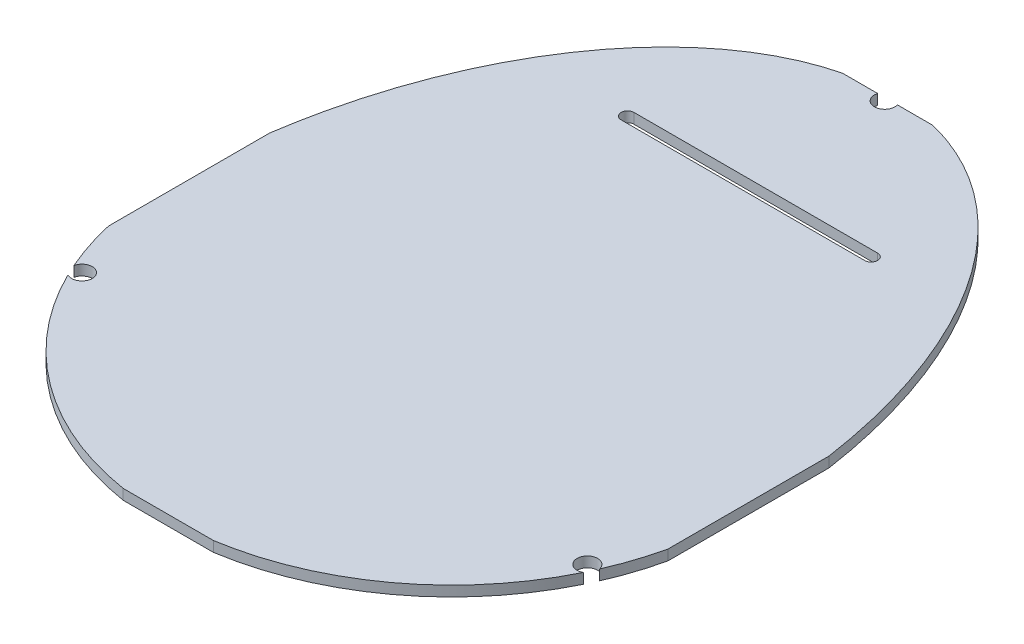
ISO-10303-21;
HEADER;
FILE_DESCRIPTION(('STEP AP214'),'2;1');
FILE_NAME('part.step','',(''),(''),'','','');
FILE_SCHEMA(('AUTOMOTIVE_DESIGN { 1 0 10303 214 1 1 1 1 }'));
ENDSEC;
DATA;
#1=APPLICATION_CONTEXT('core data for automotive mechanical design processes');
#2=APPLICATION_PROTOCOL_DEFINITION('international standard','automotive_design',2000,#1);
#3=PRODUCT_CONTEXT('',#1,'mechanical');
#4=PRODUCT('Part','Part','',(#3));
#5=PRODUCT_RELATED_PRODUCT_CATEGORY('part','',(#4));
#6=PRODUCT_DEFINITION_FORMATION('','',#4);
#7=PRODUCT_DEFINITION_CONTEXT('part definition',#1,'design');
#8=PRODUCT_DEFINITION('design','',#6,#7);
#9=PRODUCT_DEFINITION_SHAPE('','',#8);
#10=(LENGTH_UNIT() NAMED_UNIT(*) SI_UNIT(.MILLI.,.METRE.));
#11=(NAMED_UNIT(*) PLANE_ANGLE_UNIT() SI_UNIT($,.RADIAN.));
#12=(NAMED_UNIT(*) SI_UNIT($,.STERADIAN.) SOLID_ANGLE_UNIT());
#13=UNCERTAINTY_MEASURE_WITH_UNIT(LENGTH_MEASURE(1.E-05),#10,'distance_accuracy_value','');
#14=(GEOMETRIC_REPRESENTATION_CONTEXT(3) GLOBAL_UNCERTAINTY_ASSIGNED_CONTEXT((#13)) GLOBAL_UNIT_ASSIGNED_CONTEXT((#10,
#11,#12)) REPRESENTATION_CONTEXT('',''));
#15=CARTESIAN_POINT('',(0.,0.,0.));
#16=DIRECTION('',(0.,0.,1.));
#17=DIRECTION('',(1.,0.,0.));
#18=AXIS2_PLACEMENT_3D('',#15,#16,#17);
#19=CARTESIAN_POINT('',(0.,0.8,-32.4961650919178));
#20=DIRECTION('',(0.,0.,-1.));
#21=DIRECTION('',(-1.,0.,0.));
#22=AXIS2_PLACEMENT_3D('',#19,#20,#21);
#23=PLANE('',#22);
#24=DIRECTION('',(0.,1.,0.));
#25=VECTOR('',#24,1.);
#26=CARTESIAN_POINT('',(-0.76809416105592,0.,-32.4961650919178));
#27=LINE('',#26,#25);
#28=CARTESIAN_POINT('',(-0.76809416105592,0.,-32.4961650919178));
#29=VERTEX_POINT('',#28);
#30=CARTESIAN_POINT('',(-0.76809416105592,0.8,-32.4961650919178));
#31=VERTEX_POINT('',#30);
#32=EDGE_CURVE('E275',#29,#31,#27,.T.);
#33=ORIENTED_EDGE('',*,*,#32,.F.);
#34=DIRECTION('',(1.,0.,0.));
#35=VECTOR('',#34,1.);
#36=CARTESIAN_POINT('',(0.,0.,-32.4961650919178));
#37=LINE('',#36,#35);
#38=CARTESIAN_POINT('',(-3.49999999999998,0.,-32.4961650919178));
#39=VERTEX_POINT('',#38);
#40=EDGE_CURVE('E246',#39,#29,#37,.T.);
#41=ORIENTED_EDGE('',*,*,#40,.F.);
#42=DIRECTION('',(0.,-1.,0.));
#43=VECTOR('',#42,1.);
#44=CARTESIAN_POINT('',(-3.49999999999998,0.8,-32.4961650919178));
#45=LINE('',#44,#43);
#46=CARTESIAN_POINT('',(-3.49999999999998,0.8,-32.4961650919178));
#47=VERTEX_POINT('',#46);
#48=EDGE_CURVE('E208',#47,#39,#45,.T.);
#49=ORIENTED_EDGE('',*,*,#48,.F.);
#50=DIRECTION('',(1.,0.,0.));
#51=VECTOR('',#50,1.);
#52=CARTESIAN_POINT('',(0.,0.8,-32.4961650919178));
#53=LINE('',#52,#51);
#54=EDGE_CURVE('E312',#47,#31,#53,.T.);
#55=ORIENTED_EDGE('',*,*,#54,.T.);
#56=EDGE_LOOP('',(#33,#41,#49,#55));
#57=FACE_BOUND('',#56,.T.);
#58=ADVANCED_FACE('F35',(#57),#23,.T.);
#59=CARTESIAN_POINT('',(0.,0.8,1.32743362831857));
#60=DIRECTION('',(0.,-1.,0.));
#61=DIRECTION('',(0.,0.,-1.));
#62=AXIS2_PLACEMENT_3D('',#59,#60,#61);
#63=CYLINDRICAL_SURFACE('',#62,22.25);
#64=CARTESIAN_POINT('',(0.,0.,1.32743362831857));
#65=DIRECTION('',(0.,1.,0.));
#66=DIRECTION('',(0.,0.,1.));
#67=AXIS2_PLACEMENT_3D('',#64,#65,#66);
#68=CIRCLE('',#67,22.25);
#69=CARTESIAN_POINT('',(-21.6986368308332,0.,6.25));
#70=VERTEX_POINT('',#69);
#71=CARTESIAN_POINT('',(-20.3875405508873,0.,10.2387012309621));
#72=VERTEX_POINT('',#71);
#73=EDGE_CURVE('E181',#70,#72,#68,.T.);
#74=ORIENTED_EDGE('',*,*,#73,.T.);
#75=DIRECTION('',(0.,1.,0.));
#76=VECTOR('',#75,1.);
#77=CARTESIAN_POINT('',(-20.3875405508874,0.4,10.2387012309621));
#78=LINE('',#77,#76);
#79=CARTESIAN_POINT('',(-20.3875405508874,0.8,10.2387012309621));
#80=VERTEX_POINT('',#79);
#81=EDGE_CURVE('E57',#72,#80,#78,.T.);
#82=ORIENTED_EDGE('',*,*,#81,.T.);
#83=CARTESIAN_POINT('',(0.,0.8,1.32743362831857));
#84=DIRECTION('',(0.,1.,0.));
#85=DIRECTION('',(0.,0.,1.));
#86=AXIS2_PLACEMENT_3D('',#83,#84,#85);
#87=CIRCLE('',#86,22.25);
#88=CARTESIAN_POINT('',(-21.6986368308332,0.8,6.25));
#89=VERTEX_POINT('',#88);
#90=EDGE_CURVE('E232',#89,#80,#87,.T.);
#91=ORIENTED_EDGE('',*,*,#90,.F.);
#92=DIRECTION('',(0.,-1.,0.));
#93=VECTOR('',#92,1.);
#94=CARTESIAN_POINT('',(-21.6986368308332,0.8,6.25));
#95=LINE('',#94,#93);
#96=EDGE_CURVE('E202',#89,#70,#95,.T.);
#97=ORIENTED_EDGE('',*,*,#96,.T.);
#98=EDGE_LOOP('',(#74,#82,#91,#97));
#99=FACE_BOUND('',#98,.T.);
#100=ADVANCED_FACE('F327',(#99),#63,.T.);
#101=CARTESIAN_POINT('',(0.,0.8,1.32743362831857));
#102=DIRECTION('',(0.,-1.,0.));
#103=DIRECTION('',(0.,0.,-1.));
#104=AXIS2_PLACEMENT_3D('',#101,#102,#103);
#105=CYLINDRICAL_SURFACE('',#104,22.25);
#106=DIRECTION('',(0.,1.,0.));
#107=VECTOR('',#106,1.);
#108=CARTESIAN_POINT('',(19.9900500571942,0.4,11.0978173828531));
#109=LINE('',#108,#107);
#110=CARTESIAN_POINT('',(19.9900500571942,0.8,11.0978173828531));
#111=VERTEX_POINT('',#110);
#112=CARTESIAN_POINT('',(19.9900500571942,0.,11.0978173828531));
#113=VERTEX_POINT('',#112);
#114=EDGE_CURVE('E222',#111,#113,#109,.F.);
#115=ORIENTED_EDGE('',*,*,#114,.F.);
#116=CARTESIAN_POINT('',(0.,0.8,1.32743362831857));
#117=DIRECTION('',(0.,1.,0.));
#118=DIRECTION('',(0.,0.,1.));
#119=AXIS2_PLACEMENT_3D('',#116,#117,#118);
#120=CIRCLE('',#119,22.25);
#121=CARTESIAN_POINT('',(3.49999999999998,0.8,23.3004284173773));
#122=VERTEX_POINT('',#121);
#123=EDGE_CURVE('E225',#111,#122,#120,.F.);
#124=ORIENTED_EDGE('',*,*,#123,.T.);
#125=DIRECTION('',(0.,-1.,0.));
#126=VECTOR('',#125,1.);
#127=CARTESIAN_POINT('',(3.49999999999998,0.8,23.3004284173773));
#128=LINE('',#127,#126);
#129=CARTESIAN_POINT('',(3.49999999999998,0.,23.3004284173773));
#130=VERTEX_POINT('',#129);
#131=EDGE_CURVE('E196',#122,#130,#128,.T.);
#132=ORIENTED_EDGE('',*,*,#131,.T.);
#133=CARTESIAN_POINT('',(0.,0.,1.32743362831857));
#134=DIRECTION('',(0.,1.,0.));
#135=DIRECTION('',(0.,0.,1.));
#136=AXIS2_PLACEMENT_3D('',#133,#134,#135);
#137=CIRCLE('',#136,22.25);
#138=EDGE_CURVE('E189',#113,#130,#137,.F.);
#139=ORIENTED_EDGE('',*,*,#138,.F.);
#140=EDGE_LOOP('',(#115,#124,#132,#139));
#141=FACE_BOUND('',#140,.T.);
#142=ADVANCED_FACE('F221',(#141),#105,.T.);
#143=CARTESIAN_POINT('',(21.6986368308332,0.8,0.));
#144=DIRECTION('',(1.,0.,0.));
#145=DIRECTION('',(0.,0.,-1.));
#146=AXIS2_PLACEMENT_3D('',#143,#144,#145);
#147=PLANE('',#146);
#148=DIRECTION('',(0.,0.,1.));
#149=VECTOR('',#148,1.);
#150=CARTESIAN_POINT('',(21.6986368308332,0.,0.));
#151=LINE('',#150,#149);
#152=CARTESIAN_POINT('',(21.6986368308332,0.,-6.25));
#153=VERTEX_POINT('',#152);
#154=CARTESIAN_POINT('',(21.6986368308332,0.,6.25));
#155=VERTEX_POINT('',#154);
#156=EDGE_CURVE('E240',#153,#155,#151,.T.);
#157=ORIENTED_EDGE('',*,*,#156,.F.);
#158=DIRECTION('',(0.,-1.,0.));
#159=VECTOR('',#158,1.);
#160=CARTESIAN_POINT('',(21.6986368308332,0.8,-6.25));
#161=LINE('',#160,#159);
#162=CARTESIAN_POINT('',(21.6986368308332,0.8,-6.25));
#163=VERTEX_POINT('',#162);
#164=EDGE_CURVE('E165',#163,#153,#161,.T.);
#165=ORIENTED_EDGE('',*,*,#164,.F.);
#166=DIRECTION('',(0.,0.,1.));
#167=VECTOR('',#166,1.);
#168=CARTESIAN_POINT('',(21.6986368308332,0.8,0.));
#169=LINE('',#168,#167);
#170=CARTESIAN_POINT('',(21.6986368308332,0.8,6.25));
#171=VERTEX_POINT('',#170);
#172=EDGE_CURVE('E193',#163,#171,#169,.T.);
#173=ORIENTED_EDGE('',*,*,#172,.T.);
#174=DIRECTION('',(0.,-1.,0.));
#175=VECTOR('',#174,1.);
#176=CARTESIAN_POINT('',(21.6986368308332,0.8,6.25));
#177=LINE('',#176,#175);
#178=EDGE_CURVE('E194',#171,#155,#177,.T.);
#179=ORIENTED_EDGE('',*,*,#178,.T.);
#180=EDGE_LOOP('',(#157,#165,#173,#179));
#181=FACE_BOUND('',#180,.T.);
#182=ADVANCED_FACE('F37',(#181),#147,.T.);
#183=CARTESIAN_POINT('',(0.,0.8,1.32743362831857));
#184=DIRECTION('',(0.,1.,0.));
#185=DIRECTION('',(0.,0.,1.));
#186=AXIS2_PLACEMENT_3D('',#183,#184,#185);
#187=ELLIPSE('',#186,34.25,22.25);
#188=DIRECTION('',(0.,-1.,0.));
#189=VECTOR('',#188,1.);
#190=SURFACE_OF_LINEAR_EXTRUSION('',#187,#189);
#191=CARTESIAN_POINT('',(0.,0.,1.32743362831857));
#192=DIRECTION('',(0.,1.,0.));
#193=DIRECTION('',(0.,0.,1.));
#194=AXIS2_PLACEMENT_3D('',#191,#192,#193);
#195=ELLIPSE('',#194,34.25,22.25);
#196=CARTESIAN_POINT('',(3.49999999999998,0.,-32.4961650919178));
#197=VERTEX_POINT('',#196);
#198=EDGE_CURVE('E242',#153,#197,#195,.T.);
#199=ORIENTED_EDGE('',*,*,#198,.T.);
#200=DIRECTION('',(0.,-1.,0.));
#201=VECTOR('',#200,1.);
#202=CARTESIAN_POINT('',(3.49999999999998,0.8,-32.4961650919178));
#203=LINE('',#202,#201);
#204=CARTESIAN_POINT('',(3.49999999999998,0.8,-32.4961650919178));
#205=VERTEX_POINT('',#204);
#206=EDGE_CURVE('E210',#205,#197,#203,.T.);
#207=ORIENTED_EDGE('',*,*,#206,.F.);
#208=EDGE_CURVE('E261',#163,#205,#187,.T.);
#209=ORIENTED_EDGE('',*,*,#208,.F.);
#210=ORIENTED_EDGE('',*,*,#164,.T.);
#211=EDGE_LOOP('',(#199,#207,#209,#210));
#212=FACE_BOUND('',#211,.T.);
#213=ADVANCED_FACE('F260',(#212),#190,.F.);
#214=DIRECTION('',(0.,1.,0.));
#215=VECTOR('',#214,1.);
#216=CARTESIAN_POINT('',(0.76809416105592,0.,-32.4961650919178));
#217=LINE('',#216,#215);
#218=CARTESIAN_POINT('',(0.76809416105592,0.8,-32.4961650919178));
#219=VERTEX_POINT('',#218);
#220=CARTESIAN_POINT('',(0.76809416105592,0.,-32.4961650919178));
#221=VERTEX_POINT('',#220);
#222=EDGE_CURVE('E50',#219,#221,#217,.F.);
#223=ORIENTED_EDGE('',*,*,#222,.F.);
#224=EDGE_CURVE('E256',#219,#205,#53,.T.);
#225=ORIENTED_EDGE('',*,*,#224,.T.);
#226=ORIENTED_EDGE('',*,*,#206,.T.);
#227=EDGE_CURVE('E245',#221,#197,#37,.T.);
#228=ORIENTED_EDGE('',*,*,#227,.F.);
#229=EDGE_LOOP('',(#223,#225,#226,#228));
#230=FACE_BOUND('',#229,.T.);
#231=ADVANCED_FACE('F254',(#230),#23,.T.);
#232=CARTESIAN_POINT('',(-21.6986368308332,0.,-6.25));
#233=VERTEX_POINT('',#232);
#234=EDGE_CURVE('E184',#39,#233,#195,.T.);
#235=ORIENTED_EDGE('',*,*,#234,.T.);
#236=DIRECTION('',(0.,-1.,0.));
#237=VECTOR('',#236,1.);
#238=CARTESIAN_POINT('',(-21.6986368308332,0.8,-6.25));
#239=LINE('',#238,#237);
#240=CARTESIAN_POINT('',(-21.6986368308332,0.8,-6.25));
#241=VERTEX_POINT('',#240);
#242=EDGE_CURVE('E205',#241,#233,#239,.T.);
#243=ORIENTED_EDGE('',*,*,#242,.F.);
#244=EDGE_CURVE('E311',#47,#241,#187,.T.);
#245=ORIENTED_EDGE('',*,*,#244,.F.);
#246=ORIENTED_EDGE('',*,*,#48,.T.);
#247=EDGE_LOOP('',(#235,#243,#245,#246));
#248=FACE_BOUND('',#247,.T.);
#249=ADVANCED_FACE('F314',(#248),#190,.F.);
#250=CARTESIAN_POINT('',(-21.6986368308332,0.8,0.));
#251=DIRECTION('',(1.,0.,0.));
#252=DIRECTION('',(0.,0.,-1.));
#253=AXIS2_PLACEMENT_3D('',#250,#251,#252);
#254=PLANE('',#253);
#255=DIRECTION('',(0.,0.,1.));
#256=VECTOR('',#255,1.);
#257=CARTESIAN_POINT('',(-21.6986368308332,0.,0.));
#258=LINE('',#257,#256);
#259=EDGE_CURVE('E182',#233,#70,#258,.T.);
#260=ORIENTED_EDGE('',*,*,#259,.T.);
#261=ORIENTED_EDGE('',*,*,#96,.F.);
#262=DIRECTION('',(0.,0.,1.));
#263=VECTOR('',#262,1.);
#264=CARTESIAN_POINT('',(-21.6986368308332,0.8,0.));
#265=LINE('',#264,#263);
#266=EDGE_CURVE('E348',#241,#89,#265,.T.);
#267=ORIENTED_EDGE('',*,*,#266,.F.);
#268=ORIENTED_EDGE('',*,*,#242,.T.);
#269=EDGE_LOOP('',(#260,#261,#267,#268));
#270=FACE_BOUND('',#269,.T.);
#271=ADVANCED_FACE('F317',(#270),#254,.F.);
#272=CARTESIAN_POINT('',(-19.9900500571942,0.8,11.0978173828531));
#273=VERTEX_POINT('',#272);
#274=CARTESIAN_POINT('',(-3.49999999999998,0.8,23.3004284173773));
#275=VERTEX_POINT('',#274);
#276=EDGE_CURVE('E173',#273,#275,#87,.T.);
#277=ORIENTED_EDGE('',*,*,#276,.F.);
#278=DIRECTION('',(0.,1.,0.));
#279=VECTOR('',#278,1.);
#280=CARTESIAN_POINT('',(-19.9900500571942,0.4,11.0978173828531));
#281=LINE('',#280,#279);
#282=CARTESIAN_POINT('',(-19.9900500571942,0.,11.0978173828531));
#283=VERTEX_POINT('',#282);
#284=EDGE_CURVE('E159',#273,#283,#281,.F.);
#285=ORIENTED_EDGE('',*,*,#284,.T.);
#286=CARTESIAN_POINT('',(-3.49999999999998,0.,23.3004284173773));
#287=VERTEX_POINT('',#286);
#288=EDGE_CURVE('E171',#283,#287,#68,.T.);
#289=ORIENTED_EDGE('',*,*,#288,.T.);
#290=DIRECTION('',(0.,-1.,0.));
#291=VECTOR('',#290,1.);
#292=CARTESIAN_POINT('',(-3.49999999999998,0.8,23.3004284173773));
#293=LINE('',#292,#291);
#294=EDGE_CURVE('E200',#275,#287,#293,.T.);
#295=ORIENTED_EDGE('',*,*,#294,.F.);
#296=EDGE_LOOP('',(#277,#285,#289,#295));
#297=FACE_BOUND('',#296,.T.);
#298=ADVANCED_FACE('F169',(#297),#63,.T.);
#299=CARTESIAN_POINT('',(0.,0.8,23.3004284173773));
#300=DIRECTION('',(0.,0.,-1.));
#301=DIRECTION('',(-1.,0.,0.));
#302=AXIS2_PLACEMENT_3D('',#299,#300,#301);
#303=PLANE('',#302);
#304=DIRECTION('',(1.,0.,0.));
#305=VECTOR('',#304,1.);
#306=CARTESIAN_POINT('',(0.,0.,23.3004284173773));
#307=LINE('',#306,#305);
#308=EDGE_CURVE('E180',#287,#130,#307,.T.);
#309=ORIENTED_EDGE('',*,*,#308,.T.);
#310=ORIENTED_EDGE('',*,*,#131,.F.);
#311=DIRECTION('',(1.,0.,0.));
#312=VECTOR('',#311,1.);
#313=CARTESIAN_POINT('',(0.,0.8,23.3004284173773));
#314=LINE('',#313,#312);
#315=EDGE_CURVE('E230',#275,#122,#314,.T.);
#316=ORIENTED_EDGE('',*,*,#315,.F.);
#317=ORIENTED_EDGE('',*,*,#294,.T.);
#318=EDGE_LOOP('',(#309,#310,#316,#317));
#319=FACE_BOUND('',#318,.T.);
#320=ADVANCED_FACE('F229',(#319),#303,.F.);
#321=DIRECTION('',(0.,1.,0.));
#322=VECTOR('',#321,1.);
#323=CARTESIAN_POINT('',(20.3875405508874,0.4,10.2387012309621));
#324=LINE('',#323,#322);
#325=CARTESIAN_POINT('',(20.3875405508874,0.,10.2387012309621));
#326=VERTEX_POINT('',#325);
#327=CARTESIAN_POINT('',(20.3875405508874,0.8,10.2387012309621));
#328=VERTEX_POINT('',#327);
#329=EDGE_CURVE('E268',#326,#328,#324,.T.);
#330=ORIENTED_EDGE('',*,*,#329,.F.);
#331=EDGE_CURVE('E190',#155,#326,#137,.F.);
#332=ORIENTED_EDGE('',*,*,#331,.F.);
#333=ORIENTED_EDGE('',*,*,#178,.F.);
#334=EDGE_CURVE('E197',#171,#328,#120,.F.);
#335=ORIENTED_EDGE('',*,*,#334,.T.);
#336=EDGE_LOOP('',(#330,#332,#333,#335));
#337=FACE_BOUND('',#336,.T.);
#338=ADVANCED_FACE('F267',(#337),#105,.T.);
#339=CARTESIAN_POINT('',(0.,0.8,0.));
#340=DIRECTION('',(0.,1.,0.));
#341=DIRECTION('',(0.,0.,1.));
#342=AXIS2_PLACEMENT_3D('',#339,#340,#341);
#343=PLANE('',#342);
#344=CARTESIAN_POINT('',(0.,0.8,-32.2724881826228));
#345=DIRECTION('',(0.,1.,0.));
#346=DIRECTION('',(0.,0.,1.));
#347=AXIS2_PLACEMENT_3D('',#344,#345,#346);
#348=CIRCLE('',#347,0.800000000000001);
#349=EDGE_CURVE('E174',#31,#219,#348,.T.);
#350=ORIENTED_EDGE('',*,*,#349,.F.);
#351=ORIENTED_EDGE('',*,*,#54,.F.);
#352=ORIENTED_EDGE('',*,*,#244,.T.);
#353=ORIENTED_EDGE('',*,*,#266,.T.);
#354=ORIENTED_EDGE('',*,*,#90,.T.);
#355=CARTESIAN_POINT('',(-19.60344615,0.8,10.3974336173773));
#356=DIRECTION('',(0.,1.,0.));
#357=DIRECTION('',(0.,0.,1.));
#358=AXIS2_PLACEMENT_3D('',#355,#356,#357);
#359=CIRCLE('',#358,0.799999999999999);
#360=EDGE_CURVE('E343',#273,#80,#359,.T.);
#361=ORIENTED_EDGE('',*,*,#360,.F.);
#362=ORIENTED_EDGE('',*,*,#276,.T.);
#363=ORIENTED_EDGE('',*,*,#315,.T.);
#364=ORIENTED_EDGE('',*,*,#123,.F.);
#365=CARTESIAN_POINT('',(19.60344615,0.8,10.3974336173773));
#366=DIRECTION('',(0.,1.,0.));
#367=DIRECTION('',(0.,0.,1.));
#368=AXIS2_PLACEMENT_3D('',#365,#366,#367);
#369=CIRCLE('',#368,0.799999999999999);
#370=EDGE_CURVE('E341',#328,#111,#369,.T.);
#371=ORIENTED_EDGE('',*,*,#370,.F.);
#372=ORIENTED_EDGE('',*,*,#334,.F.);
#373=ORIENTED_EDGE('',*,*,#172,.F.);
#374=ORIENTED_EDGE('',*,*,#208,.T.);
#375=ORIENTED_EDGE('',*,*,#224,.F.);
#376=EDGE_LOOP('',(#350,#351,#352,#353,#354,#361,#362,#363,#364,#371,#372,#373,#374,#375));
#377=FACE_BOUND('',#376,.T.);
#378=CARTESIAN_POINT('',(-8.95,0.8,-21.2725663826227));
#379=DIRECTION('',(0.,-1.,0.));
#380=DIRECTION('',(0.,0.,-1.));
#381=AXIS2_PLACEMENT_3D('',#378,#379,#380);
#382=CIRCLE('',#381,0.5);
#383=CARTESIAN_POINT('',(-8.95,0.8,-20.7725663826227));
#384=VERTEX_POINT('',#383);
#385=CARTESIAN_POINT('',(-8.95,0.8,-21.7725663826227));
#386=VERTEX_POINT('',#385);
#387=EDGE_CURVE('E278',#384,#386,#382,.T.);
#388=ORIENTED_EDGE('',*,*,#387,.T.);
#389=DIRECTION('',(1.,0.,0.));
#390=VECTOR('',#389,1.);
#391=CARTESIAN_POINT('',(-8.95,0.8,-21.7725663826227));
#392=LINE('',#391,#390);
#393=CARTESIAN_POINT('',(9.95,0.8,-21.7725663826227));
#394=VERTEX_POINT('',#393);
#395=EDGE_CURVE('E281',#386,#394,#392,.T.);
#396=ORIENTED_EDGE('',*,*,#395,.T.);
#397=CARTESIAN_POINT('',(9.95,0.8,-21.2725663826227));
#398=DIRECTION('',(0.,-1.,0.));
#399=DIRECTION('',(0.,0.,-1.));
#400=AXIS2_PLACEMENT_3D('',#397,#398,#399);
#401=CIRCLE('',#400,0.500000000000004);
#402=CARTESIAN_POINT('',(9.95,0.8,-20.7725663826227));
#403=VERTEX_POINT('',#402);
#404=EDGE_CURVE('E285',#394,#403,#401,.T.);
#405=ORIENTED_EDGE('',*,*,#404,.T.);
#406=DIRECTION('',(-1.,0.,0.));
#407=VECTOR('',#406,1.);
#408=CARTESIAN_POINT('',(-8.95,0.8,-20.7725663826227));
#409=LINE('',#408,#407);
#410=EDGE_CURVE('E288',#403,#384,#409,.T.);
#411=ORIENTED_EDGE('',*,*,#410,.T.);
#412=EDGE_LOOP('',(#388,#396,#405,#411));
#413=FACE_BOUND('',#412,.T.);
#414=ADVANCED_FACE('F339',(#377,#413),#343,.T.);
#415=CARTESIAN_POINT('',(0.,0.,0.));
#416=DIRECTION('',(0.,1.,0.));
#417=DIRECTION('',(0.,0.,1.));
#418=AXIS2_PLACEMENT_3D('',#415,#416,#417);
#419=PLANE('',#418);
#420=DIRECTION('',(1.,0.,0.));
#421=VECTOR('',#420,1.);
#422=CARTESIAN_POINT('',(-8.95,0.,-21.7725663826227));
#423=LINE('',#422,#421);
#424=CARTESIAN_POINT('',(-8.95,0.,-21.7725663826227));
#425=VERTEX_POINT('',#424);
#426=CARTESIAN_POINT('',(9.95,0.,-21.7725663826227));
#427=VERTEX_POINT('',#426);
#428=EDGE_CURVE('E293',#425,#427,#423,.T.);
#429=ORIENTED_EDGE('',*,*,#428,.F.);
#430=CARTESIAN_POINT('',(-8.95,0.,-21.2725663826227));
#431=DIRECTION('',(0.,-1.,0.));
#432=DIRECTION('',(0.,0.,-1.));
#433=AXIS2_PLACEMENT_3D('',#430,#431,#432);
#434=CIRCLE('',#433,0.5);
#435=CARTESIAN_POINT('',(-8.95,0.,-20.7725663826227));
#436=VERTEX_POINT('',#435);
#437=EDGE_CURVE('E277',#436,#425,#434,.T.);
#438=ORIENTED_EDGE('',*,*,#437,.F.);
#439=DIRECTION('',(-1.,0.,0.));
#440=VECTOR('',#439,1.);
#441=CARTESIAN_POINT('',(-8.95,0.,-20.7725663826227));
#442=LINE('',#441,#440);
#443=CARTESIAN_POINT('',(9.95,0.,-20.7725663826227));
#444=VERTEX_POINT('',#443);
#445=EDGE_CURVE('E282',#444,#436,#442,.T.);
#446=ORIENTED_EDGE('',*,*,#445,.F.);
#447=CARTESIAN_POINT('',(9.95,0.,-21.2725663826227));
#448=DIRECTION('',(0.,-1.,0.));
#449=DIRECTION('',(0.,0.,-1.));
#450=AXIS2_PLACEMENT_3D('',#447,#448,#449);
#451=CIRCLE('',#450,0.500000000000004);
#452=EDGE_CURVE('E296',#427,#444,#451,.T.);
#453=ORIENTED_EDGE('',*,*,#452,.F.);
#454=EDGE_LOOP('',(#429,#438,#446,#453));
#455=FACE_BOUND('',#454,.T.);
#456=ORIENTED_EDGE('',*,*,#40,.T.);
#457=CARTESIAN_POINT('',(0.,0.,-32.2724881826228));
#458=DIRECTION('',(0.,1.,0.));
#459=DIRECTION('',(0.,0.,1.));
#460=AXIS2_PLACEMENT_3D('',#457,#458,#459);
#461=CIRCLE('',#460,0.800000000000001);
#462=EDGE_CURVE('E11',#29,#221,#461,.T.);
#463=ORIENTED_EDGE('',*,*,#462,.T.);
#464=ORIENTED_EDGE('',*,*,#227,.T.);
#465=ORIENTED_EDGE('',*,*,#198,.F.);
#466=ORIENTED_EDGE('',*,*,#156,.T.);
#467=ORIENTED_EDGE('',*,*,#331,.T.);
#468=CARTESIAN_POINT('',(19.60344615,0.,10.3974336173773));
#469=DIRECTION('',(0.,1.,0.));
#470=DIRECTION('',(0.,0.,1.));
#471=AXIS2_PLACEMENT_3D('',#468,#469,#470);
#472=CIRCLE('',#471,0.799999999999999);
#473=EDGE_CURVE('E43',#326,#113,#472,.T.);
#474=ORIENTED_EDGE('',*,*,#473,.T.);
#475=ORIENTED_EDGE('',*,*,#138,.T.);
#476=ORIENTED_EDGE('',*,*,#308,.F.);
#477=ORIENTED_EDGE('',*,*,#288,.F.);
#478=CARTESIAN_POINT('',(-19.60344615,0.,10.3974336173773));
#479=DIRECTION('',(0.,1.,0.));
#480=DIRECTION('',(0.,0.,1.));
#481=AXIS2_PLACEMENT_3D('',#478,#479,#480);
#482=CIRCLE('',#481,0.799999999999999);
#483=EDGE_CURVE('E156',#283,#72,#482,.T.);
#484=ORIENTED_EDGE('',*,*,#483,.T.);
#485=ORIENTED_EDGE('',*,*,#73,.F.);
#486=ORIENTED_EDGE('',*,*,#259,.F.);
#487=ORIENTED_EDGE('',*,*,#234,.F.);
#488=EDGE_LOOP('',(#456,#463,#464,#465,#466,#467,#474,#475,#476,#477,#484,#485,#486,#487));
#489=FACE_BOUND('',#488,.T.);
#490=ADVANCED_FACE('F178',(#455,#489),#419,.F.);
#491=CARTESIAN_POINT('',(-8.95,0.8,-21.2725663826227));
#492=DIRECTION('',(0.,-1.,0.));
#493=DIRECTION('',(0.,0.,-1.));
#494=AXIS2_PLACEMENT_3D('',#491,#492,#493);
#495=CYLINDRICAL_SURFACE('',#494,0.5);
#496=ORIENTED_EDGE('',*,*,#437,.T.);
#497=DIRECTION('',(0.,-1.,0.));
#498=VECTOR('',#497,1.);
#499=CARTESIAN_POINT('',(-8.95,0.8,-21.7725663826227));
#500=LINE('',#499,#498);
#501=EDGE_CURVE('E291',#386,#425,#500,.T.);
#502=ORIENTED_EDGE('',*,*,#501,.F.);
#503=ORIENTED_EDGE('',*,*,#387,.F.);
#504=DIRECTION('',(0.,-1.,0.));
#505=VECTOR('',#504,1.);
#506=CARTESIAN_POINT('',(-8.95,0.8,-20.7725663826227));
#507=LINE('',#506,#505);
#508=EDGE_CURVE('E243',#384,#436,#507,.T.);
#509=ORIENTED_EDGE('',*,*,#508,.T.);
#510=EDGE_LOOP('',(#496,#502,#503,#509));
#511=FACE_BOUND('',#510,.T.);
#512=ADVANCED_FACE('F366',(#511),#495,.F.);
#513=CARTESIAN_POINT('',(-8.95,0.8,-20.7725663826227));
#514=DIRECTION('',(0.,0.,1.));
#515=DIRECTION('',(1.,0.,0.));
#516=AXIS2_PLACEMENT_3D('',#513,#514,#515);
#517=PLANE('',#516);
#518=ORIENTED_EDGE('',*,*,#445,.T.);
#519=ORIENTED_EDGE('',*,*,#508,.F.);
#520=ORIENTED_EDGE('',*,*,#410,.F.);
#521=DIRECTION('',(0.,-1.,0.));
#522=VECTOR('',#521,1.);
#523=CARTESIAN_POINT('',(9.95,0.8,-20.7725663826227));
#524=LINE('',#523,#522);
#525=EDGE_CURVE('E302',#403,#444,#524,.T.);
#526=ORIENTED_EDGE('',*,*,#525,.T.);
#527=EDGE_LOOP('',(#518,#519,#520,#526));
#528=FACE_BOUND('',#527,.T.);
#529=ADVANCED_FACE('F372',(#528),#517,.F.);
#530=CARTESIAN_POINT('',(9.95,0.8,-21.2725663826227));
#531=DIRECTION('',(0.,-1.,0.));
#532=DIRECTION('',(0.,0.,-1.));
#533=AXIS2_PLACEMENT_3D('',#530,#531,#532);
#534=CYLINDRICAL_SURFACE('',#533,0.500000000000004);
#535=ORIENTED_EDGE('',*,*,#452,.T.);
#536=ORIENTED_EDGE('',*,*,#525,.F.);
#537=ORIENTED_EDGE('',*,*,#404,.F.);
#538=DIRECTION('',(0.,-1.,0.));
#539=VECTOR('',#538,1.);
#540=CARTESIAN_POINT('',(9.95,0.8,-21.7725663826227));
#541=LINE('',#540,#539);
#542=EDGE_CURVE('E304',#394,#427,#541,.T.);
#543=ORIENTED_EDGE('',*,*,#542,.T.);
#544=EDGE_LOOP('',(#535,#536,#537,#543));
#545=FACE_BOUND('',#544,.T.);
#546=ADVANCED_FACE('F377',(#545),#534,.F.);
#547=CARTESIAN_POINT('',(-8.95,0.8,-21.7725663826227));
#548=DIRECTION('',(0.,0.,-1.));
#549=DIRECTION('',(-1.,0.,0.));
#550=AXIS2_PLACEMENT_3D('',#547,#548,#549);
#551=PLANE('',#550);
#552=ORIENTED_EDGE('',*,*,#428,.T.);
#553=ORIENTED_EDGE('',*,*,#542,.F.);
#554=ORIENTED_EDGE('',*,*,#395,.F.);
#555=ORIENTED_EDGE('',*,*,#501,.T.);
#556=EDGE_LOOP('',(#552,#553,#554,#555));
#557=FACE_BOUND('',#556,.T.);
#558=ADVANCED_FACE('F374',(#557),#551,.F.);
#559=CARTESIAN_POINT('',(-19.60344615,0.,10.3974336173773));
#560=DIRECTION('',(0.,1.,0.));
#561=DIRECTION('',(0.,0.,1.));
#562=AXIS2_PLACEMENT_3D('',#559,#560,#561);
#563=CYLINDRICAL_SURFACE('',#562,0.799999999999999);
#564=ORIENTED_EDGE('',*,*,#483,.F.);
#565=ORIENTED_EDGE('',*,*,#284,.F.);
#566=ORIENTED_EDGE('',*,*,#360,.T.);
#567=ORIENTED_EDGE('',*,*,#81,.F.);
#568=EDGE_LOOP('',(#564,#565,#566,#567));
#569=FACE_BOUND('',#568,.T.);
#570=ADVANCED_FACE('F158',(#569),#563,.F.);
#571=CARTESIAN_POINT('',(19.60344615,0.,10.3974336173773));
#572=DIRECTION('',(0.,1.,0.));
#573=DIRECTION('',(0.,0.,1.));
#574=AXIS2_PLACEMENT_3D('',#571,#572,#573);
#575=CYLINDRICAL_SURFACE('',#574,0.799999999999999);
#576=ORIENTED_EDGE('',*,*,#114,.T.);
#577=ORIENTED_EDGE('',*,*,#473,.F.);
#578=ORIENTED_EDGE('',*,*,#329,.T.);
#579=ORIENTED_EDGE('',*,*,#370,.T.);
#580=EDGE_LOOP('',(#576,#577,#578,#579));
#581=FACE_BOUND('',#580,.T.);
#582=ADVANCED_FACE('F387',(#581),#575,.F.);
#583=CARTESIAN_POINT('',(0.,0.,-32.2724881826228));
#584=DIRECTION('',(0.,1.,0.));
#585=DIRECTION('',(0.,0.,1.));
#586=AXIS2_PLACEMENT_3D('',#583,#584,#585);
#587=CYLINDRICAL_SURFACE('',#586,0.800000000000001);
#588=ORIENTED_EDGE('',*,*,#32,.T.);
#589=ORIENTED_EDGE('',*,*,#349,.T.);
#590=ORIENTED_EDGE('',*,*,#222,.T.);
#591=ORIENTED_EDGE('',*,*,#462,.F.);
#592=EDGE_LOOP('',(#588,#589,#590,#591));
#593=FACE_BOUND('',#592,.T.);
#594=ADVANCED_FACE('F338',(#593),#587,.F.);
#595=CLOSED_SHELL('',(#58,#100,#142,#182,#213,#231,#249,#271,#298,#320,#338,#414,#490,#512,#529,
#546,#558,#570,#582,#594));
#596=MANIFOLD_SOLID_BREP('B2',#595);
#597=ADVANCED_BREP_SHAPE_REPRESENTATION('',(#18,#596),#14);
#598=SHAPE_DEFINITION_REPRESENTATION(#9,#597);
ENDSEC;
END-ISO-10303-21;
